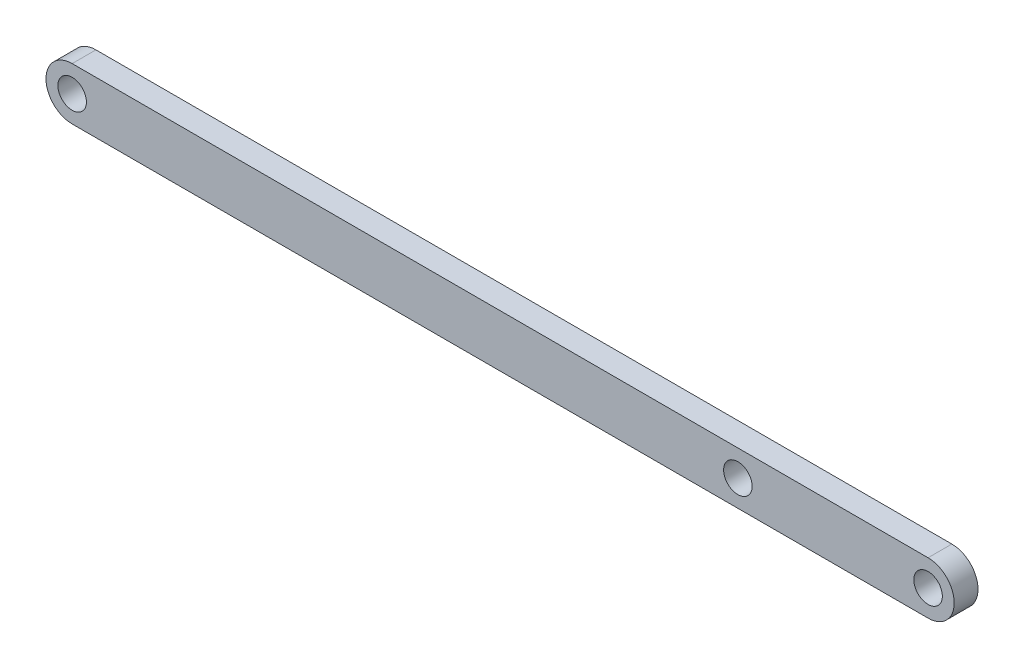
ISO-10303-21;
HEADER;
FILE_DESCRIPTION(('STEP AP214'),'2;1');
FILE_NAME('part.step','',(''),(''),'','','');
FILE_SCHEMA(('AUTOMOTIVE_DESIGN { 1 0 10303 214 1 1 1 1 }'));
ENDSEC;
DATA;
#1=APPLICATION_CONTEXT('core data for automotive mechanical design processes');
#2=APPLICATION_PROTOCOL_DEFINITION('international standard','automotive_design',2000,#1);
#3=PRODUCT_CONTEXT('',#1,'mechanical');
#4=PRODUCT('Part','Part','',(#3));
#5=PRODUCT_RELATED_PRODUCT_CATEGORY('part','',(#4));
#6=PRODUCT_DEFINITION_FORMATION('','',#4);
#7=PRODUCT_DEFINITION_CONTEXT('part definition',#1,'design');
#8=PRODUCT_DEFINITION('design','',#6,#7);
#9=PRODUCT_DEFINITION_SHAPE('','',#8);
#10=(LENGTH_UNIT() NAMED_UNIT(*) SI_UNIT(.MILLI.,.METRE.));
#11=(NAMED_UNIT(*) PLANE_ANGLE_UNIT() SI_UNIT($,.RADIAN.));
#12=(NAMED_UNIT(*) SI_UNIT($,.STERADIAN.) SOLID_ANGLE_UNIT());
#13=UNCERTAINTY_MEASURE_WITH_UNIT(LENGTH_MEASURE(1.E-05),#10,'distance_accuracy_value','');
#14=(GEOMETRIC_REPRESENTATION_CONTEXT(3) GLOBAL_UNCERTAINTY_ASSIGNED_CONTEXT((#13)) GLOBAL_UNIT_ASSIGNED_CONTEXT((#10,
#11,#12)) REPRESENTATION_CONTEXT('',''));
#15=CARTESIAN_POINT('',(0.,0.,0.));
#16=DIRECTION('',(0.,0.,1.));
#17=DIRECTION('',(1.,0.,0.));
#18=AXIS2_PLACEMENT_3D('',#15,#16,#17);
#19=CARTESIAN_POINT('',(-90.,0.,2.5));
#20=DIRECTION('',(0.,0.,1.));
#21=DIRECTION('',(1.,0.,0.));
#22=AXIS2_PLACEMENT_3D('',#19,#20,#21);
#23=PLANE('',#22);
#24=CARTESIAN_POINT('',(90.,0.,2.5));
#25=DIRECTION('',(0.,0.,1.));
#26=DIRECTION('',(1.,0.,0.));
#27=AXIS2_PLACEMENT_3D('',#24,#25,#26);
#28=CIRCLE('',#27,3.00000000000001);
#29=CARTESIAN_POINT('',(93.,0.,2.5));
#30=VERTEX_POINT('',#29);
#31=EDGE_CURVE('E118',#30,#30,#28,.T.);
#32=ORIENTED_EDGE('',*,*,#31,.F.);
#33=EDGE_LOOP('',(#32));
#34=FACE_BOUND('',#33,.T.);
#35=CARTESIAN_POINT('',(-90.,0.,2.5));
#36=DIRECTION('',(0.,0.,1.));
#37=DIRECTION('',(1.,0.,0.));
#38=AXIS2_PLACEMENT_3D('',#35,#36,#37);
#39=CIRCLE('',#38,5.5);
#40=CARTESIAN_POINT('',(-90.,5.49999999999999,2.5));
#41=VERTEX_POINT('',#40);
#42=CARTESIAN_POINT('',(-90.,-5.50000000000001,2.5));
#43=VERTEX_POINT('',#42);
#44=EDGE_CURVE('E88',#41,#43,#39,.T.);
#45=ORIENTED_EDGE('',*,*,#44,.T.);
#46=DIRECTION('',(1.,0.,0.));
#47=VECTOR('',#46,1.);
#48=CARTESIAN_POINT('',(-90.,-5.50000000000001,2.5));
#49=LINE('',#48,#47);
#50=CARTESIAN_POINT('',(90.,-5.50000000000001,2.5));
#51=VERTEX_POINT('',#50);
#52=EDGE_CURVE('E83',#43,#51,#49,.T.);
#53=ORIENTED_EDGE('',*,*,#52,.T.);
#54=CARTESIAN_POINT('',(90.,0.,2.5));
#55=DIRECTION('',(0.,0.,1.));
#56=DIRECTION('',(1.,0.,0.));
#57=AXIS2_PLACEMENT_3D('',#54,#55,#56);
#58=CIRCLE('',#57,5.5);
#59=CARTESIAN_POINT('',(90.,5.49999999999999,2.5));
#60=VERTEX_POINT('',#59);
#61=EDGE_CURVE('E86',#51,#60,#58,.T.);
#62=ORIENTED_EDGE('',*,*,#61,.T.);
#63=DIRECTION('',(-1.,0.,0.));
#64=VECTOR('',#63,1.);
#65=CARTESIAN_POINT('',(-90.,5.49999999999999,2.5));
#66=LINE('',#65,#64);
#67=EDGE_CURVE('E53',#60,#41,#66,.T.);
#68=ORIENTED_EDGE('',*,*,#67,.T.);
#69=EDGE_LOOP('',(#45,#53,#62,#68));
#70=FACE_BOUND('',#69,.T.);
#71=CARTESIAN_POINT('',(-90.,0.,2.5));
#72=DIRECTION('',(0.,0.,1.));
#73=DIRECTION('',(1.,0.,0.));
#74=AXIS2_PLACEMENT_3D('',#71,#72,#73);
#75=CIRCLE('',#74,3.00000000000001);
#76=CARTESIAN_POINT('',(-87.,0.,2.5));
#77=VERTEX_POINT('',#76);
#78=EDGE_CURVE('E103',#77,#77,#75,.T.);
#79=ORIENTED_EDGE('',*,*,#78,.F.);
#80=EDGE_LOOP('',(#79));
#81=FACE_BOUND('',#80,.T.);
#82=CARTESIAN_POINT('',(50.,0.,2.5));
#83=DIRECTION('',(0.,0.,1.));
#84=DIRECTION('',(1.,0.,0.));
#85=AXIS2_PLACEMENT_3D('',#82,#83,#84);
#86=CIRCLE('',#85,3.00000000000001);
#87=CARTESIAN_POINT('',(53.,0.,2.5));
#88=VERTEX_POINT('',#87);
#89=EDGE_CURVE('E124',#88,#88,#86,.T.);
#90=ORIENTED_EDGE('',*,*,#89,.F.);
#91=EDGE_LOOP('',(#90));
#92=FACE_BOUND('',#91,.T.);
#93=ADVANCED_FACE('F36',(#34,#70,#81,#92),#23,.T.);
#94=CARTESIAN_POINT('',(-90.,0.,-2.5));
#95=DIRECTION('',(0.,0.,1.));
#96=DIRECTION('',(1.,0.,0.));
#97=AXIS2_PLACEMENT_3D('',#94,#95,#96);
#98=PLANE('',#97);
#99=CARTESIAN_POINT('',(-90.,0.,-2.5));
#100=DIRECTION('',(0.,0.,1.));
#101=DIRECTION('',(1.,0.,0.));
#102=AXIS2_PLACEMENT_3D('',#99,#100,#101);
#103=CIRCLE('',#102,5.5);
#104=CARTESIAN_POINT('',(-90.,5.49999999999999,-2.5));
#105=VERTEX_POINT('',#104);
#106=CARTESIAN_POINT('',(-90.,-5.50000000000001,-2.5));
#107=VERTEX_POINT('',#106);
#108=EDGE_CURVE('E100',#105,#107,#103,.T.);
#109=ORIENTED_EDGE('',*,*,#108,.F.);
#110=DIRECTION('',(-1.,0.,0.));
#111=VECTOR('',#110,1.);
#112=CARTESIAN_POINT('',(-90.,5.49999999999999,-2.5));
#113=LINE('',#112,#111);
#114=CARTESIAN_POINT('',(90.,5.49999999999999,-2.5));
#115=VERTEX_POINT('',#114);
#116=EDGE_CURVE('E76',#115,#105,#113,.T.);
#117=ORIENTED_EDGE('',*,*,#116,.F.);
#118=CARTESIAN_POINT('',(90.,0.,-2.5));
#119=DIRECTION('',(0.,0.,1.));
#120=DIRECTION('',(1.,0.,0.));
#121=AXIS2_PLACEMENT_3D('',#118,#119,#120);
#122=CIRCLE('',#121,5.5);
#123=CARTESIAN_POINT('',(90.,-5.50000000000001,-2.5));
#124=VERTEX_POINT('',#123);
#125=EDGE_CURVE('E70',#124,#115,#122,.T.);
#126=ORIENTED_EDGE('',*,*,#125,.F.);
#127=DIRECTION('',(1.,0.,0.));
#128=VECTOR('',#127,1.);
#129=CARTESIAN_POINT('',(-90.,-5.50000000000001,-2.5));
#130=LINE('',#129,#128);
#131=EDGE_CURVE('E92',#107,#124,#130,.T.);
#132=ORIENTED_EDGE('',*,*,#131,.F.);
#133=EDGE_LOOP('',(#109,#117,#126,#132));
#134=FACE_BOUND('',#133,.T.);
#135=CARTESIAN_POINT('',(-90.,0.,-2.5));
#136=DIRECTION('',(0.,0.,1.));
#137=DIRECTION('',(1.,0.,0.));
#138=AXIS2_PLACEMENT_3D('',#135,#136,#137);
#139=CIRCLE('',#138,3.00000000000001);
#140=CARTESIAN_POINT('',(-87.,0.,-2.5));
#141=VERTEX_POINT('',#140);
#142=EDGE_CURVE('E115',#141,#141,#139,.T.);
#143=ORIENTED_EDGE('',*,*,#142,.T.);
#144=EDGE_LOOP('',(#143));
#145=FACE_BOUND('',#144,.T.);
#146=CARTESIAN_POINT('',(90.,0.,-2.5));
#147=DIRECTION('',(0.,0.,1.));
#148=DIRECTION('',(1.,0.,0.));
#149=AXIS2_PLACEMENT_3D('',#146,#147,#148);
#150=CIRCLE('',#149,3.00000000000001);
#151=CARTESIAN_POINT('',(93.,0.,-2.5));
#152=VERTEX_POINT('',#151);
#153=EDGE_CURVE('E121',#152,#152,#150,.T.);
#154=ORIENTED_EDGE('',*,*,#153,.T.);
#155=EDGE_LOOP('',(#154));
#156=FACE_BOUND('',#155,.T.);
#157=CARTESIAN_POINT('',(50.,0.,-2.5));
#158=DIRECTION('',(0.,0.,1.));
#159=DIRECTION('',(1.,0.,0.));
#160=AXIS2_PLACEMENT_3D('',#157,#158,#159);
#161=CIRCLE('',#160,3.00000000000001);
#162=CARTESIAN_POINT('',(53.,0.,-2.5));
#163=VERTEX_POINT('',#162);
#164=EDGE_CURVE('E127',#163,#163,#161,.T.);
#165=ORIENTED_EDGE('',*,*,#164,.T.);
#166=EDGE_LOOP('',(#165));
#167=FACE_BOUND('',#166,.T.);
#168=ADVANCED_FACE('F111',(#134,#145,#156,#167),#98,.F.);
#169=CARTESIAN_POINT('',(-90.,0.,2.5));
#170=DIRECTION('',(0.,0.,-1.));
#171=DIRECTION('',(-1.,0.,0.));
#172=AXIS2_PLACEMENT_3D('',#169,#170,#171);
#173=CYLINDRICAL_SURFACE('',#172,5.5);
#174=ORIENTED_EDGE('',*,*,#108,.T.);
#175=DIRECTION('',(0.,0.,-1.));
#176=VECTOR('',#175,1.);
#177=CARTESIAN_POINT('',(-90.,-5.50000000000001,2.5));
#178=LINE('',#177,#176);
#179=EDGE_CURVE('E11',#43,#107,#178,.T.);
#180=ORIENTED_EDGE('',*,*,#179,.F.);
#181=ORIENTED_EDGE('',*,*,#44,.F.);
#182=DIRECTION('',(0.,0.,-1.));
#183=VECTOR('',#182,1.);
#184=CARTESIAN_POINT('',(-90.,5.49999999999999,2.5));
#185=LINE('',#184,#183);
#186=EDGE_CURVE('E96',#41,#105,#185,.T.);
#187=ORIENTED_EDGE('',*,*,#186,.T.);
#188=EDGE_LOOP('',(#174,#180,#181,#187));
#189=FACE_BOUND('',#188,.T.);
#190=ADVANCED_FACE('F38',(#189),#173,.T.);
#191=CARTESIAN_POINT('',(-90.,-5.50000000000001,2.5));
#192=DIRECTION('',(0.,1.,0.));
#193=DIRECTION('',(0.,0.,1.));
#194=AXIS2_PLACEMENT_3D('',#191,#192,#193);
#195=PLANE('',#194);
#196=ORIENTED_EDGE('',*,*,#131,.T.);
#197=DIRECTION('',(0.,0.,-1.));
#198=VECTOR('',#197,1.);
#199=CARTESIAN_POINT('',(90.,-5.50000000000001,2.5));
#200=LINE('',#199,#198);
#201=EDGE_CURVE('E45',#51,#124,#200,.T.);
#202=ORIENTED_EDGE('',*,*,#201,.F.);
#203=ORIENTED_EDGE('',*,*,#52,.F.);
#204=ORIENTED_EDGE('',*,*,#179,.T.);
#205=EDGE_LOOP('',(#196,#202,#203,#204));
#206=FACE_BOUND('',#205,.T.);
#207=ADVANCED_FACE('F91',(#206),#195,.F.);
#208=CARTESIAN_POINT('',(90.,0.,2.5));
#209=DIRECTION('',(0.,0.,-1.));
#210=DIRECTION('',(-1.,0.,0.));
#211=AXIS2_PLACEMENT_3D('',#208,#209,#210);
#212=CYLINDRICAL_SURFACE('',#211,5.5);
#213=ORIENTED_EDGE('',*,*,#125,.T.);
#214=DIRECTION('',(0.,0.,-1.));
#215=VECTOR('',#214,1.);
#216=CARTESIAN_POINT('',(90.,5.49999999999999,2.5));
#217=LINE('',#216,#215);
#218=EDGE_CURVE('E93',#60,#115,#217,.T.);
#219=ORIENTED_EDGE('',*,*,#218,.F.);
#220=ORIENTED_EDGE('',*,*,#61,.F.);
#221=ORIENTED_EDGE('',*,*,#201,.T.);
#222=EDGE_LOOP('',(#213,#219,#220,#221));
#223=FACE_BOUND('',#222,.T.);
#224=ADVANCED_FACE('F94',(#223),#212,.T.);
#225=CARTESIAN_POINT('',(-90.,5.49999999999999,2.5));
#226=DIRECTION('',(0.,-1.,0.));
#227=DIRECTION('',(0.,0.,-1.));
#228=AXIS2_PLACEMENT_3D('',#225,#226,#227);
#229=PLANE('',#228);
#230=ORIENTED_EDGE('',*,*,#116,.T.);
#231=ORIENTED_EDGE('',*,*,#186,.F.);
#232=ORIENTED_EDGE('',*,*,#67,.F.);
#233=ORIENTED_EDGE('',*,*,#218,.T.);
#234=EDGE_LOOP('',(#230,#231,#232,#233));
#235=FACE_BOUND('',#234,.T.);
#236=ADVANCED_FACE('F108',(#235),#229,.F.);
#237=CARTESIAN_POINT('',(-90.,0.,2.5));
#238=DIRECTION('',(0.,0.,-1.));
#239=DIRECTION('',(-1.,0.,0.));
#240=AXIS2_PLACEMENT_3D('',#237,#238,#239);
#241=CYLINDRICAL_SURFACE('',#240,3.00000000000001);
#242=ORIENTED_EDGE('',*,*,#78,.T.);
#243=EDGE_LOOP('',(#242));
#244=FACE_BOUND('',#243,.T.);
#245=ORIENTED_EDGE('',*,*,#142,.F.);
#246=EDGE_LOOP('',(#245));
#247=FACE_BOUND('',#246,.T.);
#248=ADVANCED_FACE('F145',(#244,#247),#241,.F.);
#249=CARTESIAN_POINT('',(90.,0.,2.5));
#250=DIRECTION('',(0.,0.,-1.));
#251=DIRECTION('',(-1.,0.,0.));
#252=AXIS2_PLACEMENT_3D('',#249,#250,#251);
#253=CYLINDRICAL_SURFACE('',#252,3.00000000000001);
#254=ORIENTED_EDGE('',*,*,#31,.T.);
#255=EDGE_LOOP('',(#254));
#256=FACE_BOUND('',#255,.T.);
#257=ORIENTED_EDGE('',*,*,#153,.F.);
#258=EDGE_LOOP('',(#257));
#259=FACE_BOUND('',#258,.T.);
#260=ADVANCED_FACE('F199',(#256,#259),#253,.F.);
#261=CARTESIAN_POINT('',(50.,0.,2.5));
#262=DIRECTION('',(0.,0.,-1.));
#263=DIRECTION('',(-1.,0.,0.));
#264=AXIS2_PLACEMENT_3D('',#261,#262,#263);
#265=CYLINDRICAL_SURFACE('',#264,3.00000000000001);
#266=ORIENTED_EDGE('',*,*,#89,.T.);
#267=EDGE_LOOP('',(#266));
#268=FACE_BOUND('',#267,.T.);
#269=ORIENTED_EDGE('',*,*,#164,.F.);
#270=EDGE_LOOP('',(#269));
#271=FACE_BOUND('',#270,.T.);
#272=ADVANCED_FACE('F133',(#268,#271),#265,.F.);
#273=CLOSED_SHELL('',(#93,#168,#190,#207,#224,#236,#248,#260,#272));
#274=MANIFOLD_SOLID_BREP('B2',#273);
#275=ADVANCED_BREP_SHAPE_REPRESENTATION('',(#18,#274),#14);
#276=SHAPE_DEFINITION_REPRESENTATION(#9,#275);
ENDSEC;
END-ISO-10303-21;
